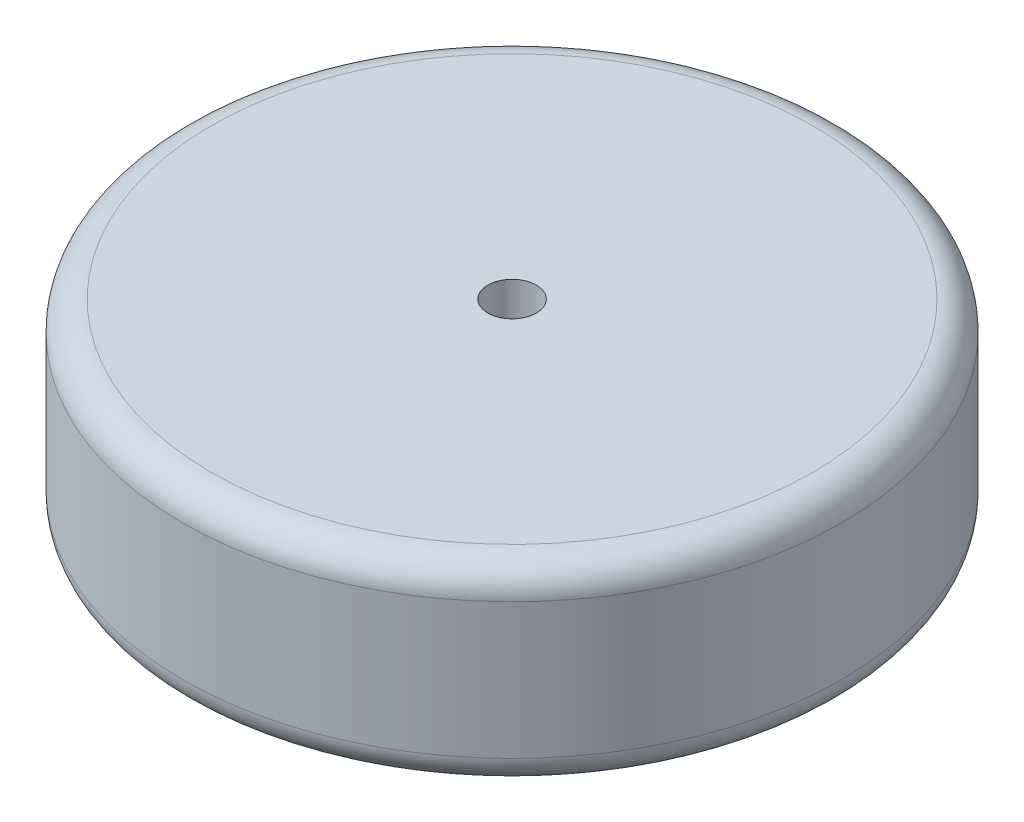
ISO-10303-21;
HEADER;
FILE_DESCRIPTION(('STEP AP214'),'2;1');
FILE_NAME('part.step','',(''),(''),'','','');
FILE_SCHEMA(('AUTOMOTIVE_DESIGN { 1 0 10303 214 1 1 1 1 }'));
ENDSEC;
DATA;
#1=APPLICATION_CONTEXT('core data for automotive mechanical design processes');
#2=APPLICATION_PROTOCOL_DEFINITION('international standard','automotive_design',2000,#1);
#3=PRODUCT_CONTEXT('',#1,'mechanical');
#4=PRODUCT('Part','Part','',(#3));
#5=PRODUCT_RELATED_PRODUCT_CATEGORY('part','',(#4));
#6=PRODUCT_DEFINITION_FORMATION('','',#4);
#7=PRODUCT_DEFINITION_CONTEXT('part definition',#1,'design');
#8=PRODUCT_DEFINITION('design','',#6,#7);
#9=PRODUCT_DEFINITION_SHAPE('','',#8);
#10=(LENGTH_UNIT() NAMED_UNIT(*) SI_UNIT(.MILLI.,.METRE.));
#11=(NAMED_UNIT(*) PLANE_ANGLE_UNIT() SI_UNIT($,.RADIAN.));
#12=(NAMED_UNIT(*) SI_UNIT($,.STERADIAN.) SOLID_ANGLE_UNIT());
#13=UNCERTAINTY_MEASURE_WITH_UNIT(LENGTH_MEASURE(1.E-05),#10,'distance_accuracy_value','');
#14=(GEOMETRIC_REPRESENTATION_CONTEXT(3) GLOBAL_UNCERTAINTY_ASSIGNED_CONTEXT((#13)) GLOBAL_UNIT_ASSIGNED_CONTEXT((#10,
#11,#12)) REPRESENTATION_CONTEXT('',''));
#15=CARTESIAN_POINT('',(0.,0.,0.));
#16=DIRECTION('',(0.,0.,1.));
#17=DIRECTION('',(1.,0.,0.));
#18=AXIS2_PLACEMENT_3D('',#15,#16,#17);
#19=CARTESIAN_POINT('',(0.,20.,0.));
#20=DIRECTION('',(0.,1.,0.));
#21=DIRECTION('',(0.,0.,1.));
#22=AXIS2_PLACEMENT_3D('',#19,#20,#21);
#23=PLANE('',#22);
#24=CARTESIAN_POINT('',(0.,20.,0.));
#25=DIRECTION('',(0.,1.,0.));
#26=DIRECTION('',(0.,0.,1.));
#27=AXIS2_PLACEMENT_3D('',#24,#25,#26);
#28=CIRCLE('',#27,31.);
#29=CARTESIAN_POINT('',(0.,20.,31.));
#30=VERTEX_POINT('',#29);
#31=EDGE_CURVE('E10',#30,#30,#28,.T.);
#32=ORIENTED_EDGE('',*,*,#31,.T.);
#33=EDGE_LOOP('',(#32));
#34=FACE_BOUND('',#33,.T.);
#35=CARTESIAN_POINT('',(0.,20.,0.));
#36=DIRECTION('',(0.,1.,0.));
#37=DIRECTION('',(0.,0.,1.));
#38=AXIS2_PLACEMENT_3D('',#35,#36,#37);
#39=CIRCLE('',#38,2.5);
#40=CARTESIAN_POINT('',(0.,20.,2.5));
#41=VERTEX_POINT('',#40);
#42=EDGE_CURVE('E61',#41,#41,#39,.T.);
#43=ORIENTED_EDGE('',*,*,#42,.F.);
#44=EDGE_LOOP('',(#43));
#45=FACE_BOUND('',#44,.T.);
#46=ADVANCED_FACE('F37',(#34,#45),#23,.T.);
#47=CARTESIAN_POINT('',(0.,0.,0.));
#48=DIRECTION('',(0.,1.,0.));
#49=DIRECTION('',(0.,0.,1.));
#50=AXIS2_PLACEMENT_3D('',#47,#48,#49);
#51=PLANE('',#50);
#52=CARTESIAN_POINT('',(0.,0.,0.));
#53=DIRECTION('',(0.,1.,0.));
#54=DIRECTION('',(0.,0.,1.));
#55=AXIS2_PLACEMENT_3D('',#52,#53,#54);
#56=CIRCLE('',#55,31.);
#57=CARTESIAN_POINT('',(0.,0.,31.));
#58=VERTEX_POINT('',#57);
#59=EDGE_CURVE('E45',#58,#58,#56,.F.);
#60=ORIENTED_EDGE('',*,*,#59,.T.);
#61=EDGE_LOOP('',(#60));
#62=FACE_BOUND('',#61,.T.);
#63=CARTESIAN_POINT('',(0.,0.,0.));
#64=DIRECTION('',(0.,1.,0.));
#65=DIRECTION('',(0.,0.,1.));
#66=AXIS2_PLACEMENT_3D('',#63,#64,#65);
#67=CIRCLE('',#66,2.5);
#68=CARTESIAN_POINT('',(0.,0.,2.5));
#69=VERTEX_POINT('',#68);
#70=EDGE_CURVE('E62',#69,#69,#67,.T.);
#71=ORIENTED_EDGE('',*,*,#70,.T.);
#72=EDGE_LOOP('',(#71));
#73=FACE_BOUND('',#72,.T.);
#74=ADVANCED_FACE('F74',(#62,#73),#51,.F.);
#75=CARTESIAN_POINT('',(0.,20.,0.));
#76=DIRECTION('',(0.,-1.,0.));
#77=DIRECTION('',(0.,0.,-1.));
#78=AXIS2_PLACEMENT_3D('',#75,#76,#77);
#79=CYLINDRICAL_SURFACE('',#78,34.);
#80=CARTESIAN_POINT('',(0.,3.,0.));
#81=DIRECTION('',(0.,1.,0.));
#82=DIRECTION('',(0.,0.,1.));
#83=AXIS2_PLACEMENT_3D('',#80,#81,#82);
#84=CIRCLE('',#83,34.);
#85=CARTESIAN_POINT('',(0.,3.,34.));
#86=VERTEX_POINT('',#85);
#87=EDGE_CURVE('E50',#86,#86,#84,.T.);
#88=ORIENTED_EDGE('',*,*,#87,.T.);
#89=EDGE_LOOP('',(#88));
#90=FACE_BOUND('',#89,.T.);
#91=CARTESIAN_POINT('',(0.,17.,0.));
#92=DIRECTION('',(0.,1.,0.));
#93=DIRECTION('',(0.,0.,1.));
#94=AXIS2_PLACEMENT_3D('',#91,#92,#93);
#95=CIRCLE('',#94,34.);
#96=CARTESIAN_POINT('',(0.,17.,34.));
#97=VERTEX_POINT('',#96);
#98=EDGE_CURVE('E55',#97,#97,#95,.F.);
#99=ORIENTED_EDGE('',*,*,#98,.T.);
#100=EDGE_LOOP('',(#99));
#101=FACE_BOUND('',#100,.T.);
#102=ADVANCED_FACE('F79',(#90,#101),#79,.T.);
#103=CARTESIAN_POINT('',(0.,20.,0.));
#104=DIRECTION('',(0.,-1.,0.));
#105=DIRECTION('',(0.,0.,-1.));
#106=AXIS2_PLACEMENT_3D('',#103,#104,#105);
#107=CYLINDRICAL_SURFACE('',#106,2.5);
#108=ORIENTED_EDGE('',*,*,#42,.T.);
#109=EDGE_LOOP('',(#108));
#110=FACE_BOUND('',#109,.T.);
#111=ORIENTED_EDGE('',*,*,#70,.F.);
#112=EDGE_LOOP('',(#111));
#113=FACE_BOUND('',#112,.T.);
#114=ADVANCED_FACE('F70',(#110,#113),#107,.F.);
#115=CARTESIAN_POINT('',(0.,3.,0.));
#116=DIRECTION('',(0.,1.,0.));
#117=DIRECTION('',(0.,0.,1.));
#118=AXIS2_PLACEMENT_3D('',#115,#116,#117);
#119=TOROIDAL_SURFACE('',#118,31.,3.);
#120=ORIENTED_EDGE('',*,*,#59,.F.);
#121=EDGE_LOOP('',(#120));
#122=FACE_BOUND('',#121,.T.);
#123=ORIENTED_EDGE('',*,*,#87,.F.);
#124=EDGE_LOOP('',(#123));
#125=FACE_BOUND('',#124,.T.);
#126=ADVANCED_FACE('F85',(#122,#125),#119,.T.);
#127=CARTESIAN_POINT('',(0.,17.,0.));
#128=DIRECTION('',(0.,1.,0.));
#129=DIRECTION('',(0.,0.,1.));
#130=AXIS2_PLACEMENT_3D('',#127,#128,#129);
#131=TOROIDAL_SURFACE('',#130,31.,3.);
#132=ORIENTED_EDGE('',*,*,#98,.F.);
#133=EDGE_LOOP('',(#132));
#134=FACE_BOUND('',#133,.T.);
#135=ORIENTED_EDGE('',*,*,#31,.F.);
#136=EDGE_LOOP('',(#135));
#137=FACE_BOUND('',#136,.T.);
#138=ADVANCED_FACE('F39',(#134,#137),#131,.T.);
#139=CLOSED_SHELL('',(#46,#74,#102,#114,#126,#138));
#140=MANIFOLD_SOLID_BREP('B2',#139);
#141=ADVANCED_BREP_SHAPE_REPRESENTATION('',(#18,#140),#14);
#142=SHAPE_DEFINITION_REPRESENTATION(#9,#141);
ENDSEC;
END-ISO-10303-21;
